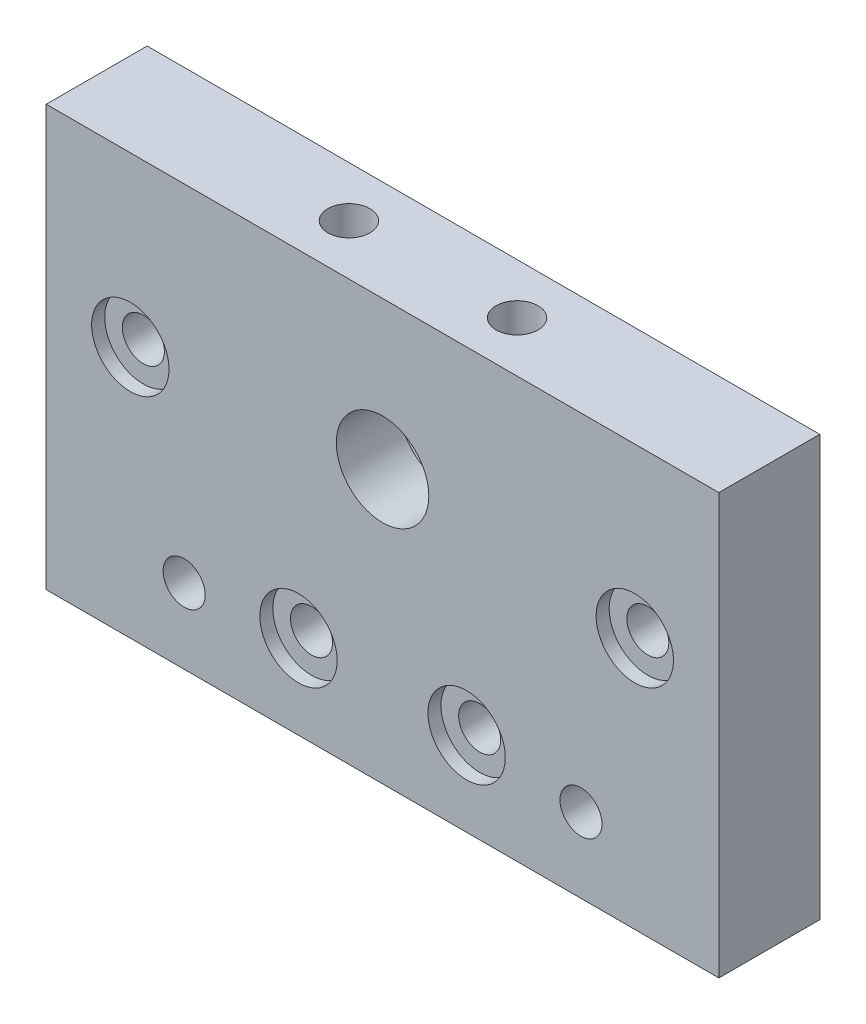
ISO-10303-21;
HEADER;
FILE_DESCRIPTION(('STEP AP214'),'2;1');
FILE_NAME('part.step','',(''),(''),'','','');
FILE_SCHEMA(('AUTOMOTIVE_DESIGN { 1 0 10303 214 1 1 1 1 }'));
ENDSEC;
DATA;
#1=APPLICATION_CONTEXT('core data for automotive mechanical design processes');
#2=APPLICATION_PROTOCOL_DEFINITION('international standard','automotive_design',2000,#1);
#3=PRODUCT_CONTEXT('',#1,'mechanical');
#4=PRODUCT('Part','Part','',(#3));
#5=PRODUCT_RELATED_PRODUCT_CATEGORY('part','',(#4));
#6=PRODUCT_DEFINITION_FORMATION('','',#4);
#7=PRODUCT_DEFINITION_CONTEXT('part definition',#1,'design');
#8=PRODUCT_DEFINITION('design','',#6,#7);
#9=PRODUCT_DEFINITION_SHAPE('','',#8);
#10=(LENGTH_UNIT() NAMED_UNIT(*) SI_UNIT(.MILLI.,.METRE.));
#11=(NAMED_UNIT(*) PLANE_ANGLE_UNIT() SI_UNIT($,.RADIAN.));
#12=(NAMED_UNIT(*) SI_UNIT($,.STERADIAN.) SOLID_ANGLE_UNIT());
#13=UNCERTAINTY_MEASURE_WITH_UNIT(LENGTH_MEASURE(1.E-05),#10,'distance_accuracy_value','');
#14=(GEOMETRIC_REPRESENTATION_CONTEXT(3) GLOBAL_UNCERTAINTY_ASSIGNED_CONTEXT((#13)) GLOBAL_UNIT_ASSIGNED_CONTEXT((#10,
#11,#12)) REPRESENTATION_CONTEXT('',''));
#15=CARTESIAN_POINT('',(0.,0.,0.));
#16=DIRECTION('',(0.,0.,1.));
#17=DIRECTION('',(1.,0.,0.));
#18=AXIS2_PLACEMENT_3D('',#15,#16,#17);
#19=CARTESIAN_POINT('',(40.,32.4,12.));
#20=DIRECTION('',(0.,0.,-1.));
#21=DIRECTION('',(-1.,0.,0.));
#22=AXIS2_PLACEMENT_3D('',#19,#20,#21);
#23=CYLINDRICAL_SURFACE('',#22,5.5);
#24=CARTESIAN_POINT('',(40.,32.4,12.));
#25=DIRECTION('',(0.,0.,1.));
#26=DIRECTION('',(1.,0.,0.));
#27=AXIS2_PLACEMENT_3D('',#24,#25,#26);
#28=CIRCLE('',#27,5.5);
#29=CARTESIAN_POINT('',(45.5,32.4,12.));
#30=VERTEX_POINT('',#29);
#31=EDGE_CURVE('E105',#30,#30,#28,.T.);
#32=ORIENTED_EDGE('',*,*,#31,.T.);
#33=EDGE_LOOP('',(#32));
#34=FACE_BOUND('',#33,.T.);
#35=CARTESIAN_POINT('',(40.,32.4,4.5));
#36=DIRECTION('',(0.,0.,-1.));
#37=DIRECTION('',(-1.,0.,0.));
#38=AXIS2_PLACEMENT_3D('',#35,#36,#37);
#39=CIRCLE('',#38,5.5);
#40=CARTESIAN_POINT('',(34.5,32.4,4.5));
#41=VERTEX_POINT('',#40);
#42=EDGE_CURVE('E38',#41,#41,#39,.T.);
#43=ORIENTED_EDGE('',*,*,#42,.T.);
#44=EDGE_LOOP('',(#43));
#45=FACE_BOUND('',#44,.T.);
#46=ADVANCED_FACE('F34',(#34,#45),#23,.F.);
#47=CARTESIAN_POINT('',(30.,10.,12.));
#48=DIRECTION('',(0.,0.,-1.));
#49=DIRECTION('',(-1.,0.,0.));
#50=AXIS2_PLACEMENT_3D('',#47,#48,#49);
#51=CYLINDRICAL_SURFACE('',#50,2.5);
#52=CARTESIAN_POINT('',(30.,10.,0.));
#53=DIRECTION('',(0.,0.,1.));
#54=DIRECTION('',(1.,0.,0.));
#55=AXIS2_PLACEMENT_3D('',#52,#53,#54);
#56=CIRCLE('',#55,2.5);
#57=CARTESIAN_POINT('',(32.5,10.,0.));
#58=VERTEX_POINT('',#57);
#59=EDGE_CURVE('E168',#58,#58,#56,.T.);
#60=ORIENTED_EDGE('',*,*,#59,.F.);
#61=EDGE_LOOP('',(#60));
#62=FACE_BOUND('',#61,.T.);
#63=CARTESIAN_POINT('',(30.,10.,10.45));
#64=DIRECTION('',(0.,0.,1.));
#65=DIRECTION('',(1.,0.,0.));
#66=AXIS2_PLACEMENT_3D('',#63,#64,#65);
#67=CIRCLE('',#66,2.5);
#68=CARTESIAN_POINT('',(32.5,10.,10.45));
#69=VERTEX_POINT('',#68);
#70=EDGE_CURVE('E121',#69,#69,#67,.T.);
#71=ORIENTED_EDGE('',*,*,#70,.T.);
#72=EDGE_LOOP('',(#71));
#73=FACE_BOUND('',#72,.T.);
#74=ADVANCED_FACE('F210',(#62,#73),#51,.F.);
#75=CARTESIAN_POINT('',(10.,30.,12.));
#76=DIRECTION('',(0.,0.,-1.));
#77=DIRECTION('',(-1.,0.,0.));
#78=AXIS2_PLACEMENT_3D('',#75,#76,#77);
#79=CYLINDRICAL_SURFACE('',#78,2.5);
#80=CARTESIAN_POINT('',(10.,30.,0.));
#81=DIRECTION('',(0.,0.,1.));
#82=DIRECTION('',(1.,0.,0.));
#83=AXIS2_PLACEMENT_3D('',#80,#81,#82);
#84=CIRCLE('',#83,2.5);
#85=CARTESIAN_POINT('',(12.5,30.,0.));
#86=VERTEX_POINT('',#85);
#87=EDGE_CURVE('E174',#86,#86,#84,.T.);
#88=ORIENTED_EDGE('',*,*,#87,.F.);
#89=EDGE_LOOP('',(#88));
#90=FACE_BOUND('',#89,.T.);
#91=CARTESIAN_POINT('',(10.,30.,10.45));
#92=DIRECTION('',(0.,0.,1.));
#93=DIRECTION('',(1.,0.,0.));
#94=AXIS2_PLACEMENT_3D('',#91,#92,#93);
#95=CIRCLE('',#94,2.5);
#96=CARTESIAN_POINT('',(12.5,30.,10.45));
#97=VERTEX_POINT('',#96);
#98=EDGE_CURVE('E111',#97,#97,#95,.T.);
#99=ORIENTED_EDGE('',*,*,#98,.T.);
#100=EDGE_LOOP('',(#99));
#101=FACE_BOUND('',#100,.T.);
#102=ADVANCED_FACE('F184',(#90,#101),#79,.F.);
#103=CARTESIAN_POINT('',(0.,0.,12.));
#104=DIRECTION('',(0.,0.,-1.));
#105=DIRECTION('',(-1.,0.,0.));
#106=AXIS2_PLACEMENT_3D('',#103,#104,#105);
#107=PLANE('',#106);
#108=CARTESIAN_POINT('',(50.,10.,12.));
#109=DIRECTION('',(0.,0.,1.));
#110=DIRECTION('',(-1.,0.,0.));
#111=AXIS2_PLACEMENT_3D('',#108,#109,#110);
#112=CIRCLE('',#111,4.6);
#113=CARTESIAN_POINT('',(45.4,10.,12.));
#114=VERTEX_POINT('',#113);
#115=EDGE_CURVE('E134',#114,#114,#112,.T.);
#116=ORIENTED_EDGE('',*,*,#115,.F.);
#117=EDGE_LOOP('',(#116));
#118=FACE_BOUND('',#117,.T.);
#119=CARTESIAN_POINT('',(30.,10.,12.));
#120=DIRECTION('',(0.,0.,1.));
#121=DIRECTION('',(1.,0.,0.));
#122=AXIS2_PLACEMENT_3D('',#119,#120,#121);
#123=CIRCLE('',#122,4.6);
#124=CARTESIAN_POINT('',(34.6,10.,12.));
#125=VERTEX_POINT('',#124);
#126=EDGE_CURVE('E127',#125,#125,#123,.T.);
#127=ORIENTED_EDGE('',*,*,#126,.F.);
#128=EDGE_LOOP('',(#127));
#129=FACE_BOUND('',#128,.T.);
#130=CARTESIAN_POINT('',(70.,30.,12.));
#131=DIRECTION('',(0.,0.,1.));
#132=DIRECTION('',(-1.,0.,0.));
#133=AXIS2_PLACEMENT_3D('',#130,#131,#132);
#134=CIRCLE('',#133,4.60000000000001);
#135=CARTESIAN_POINT('',(65.4,30.,12.));
#136=VERTEX_POINT('',#135);
#137=EDGE_CURVE('E123',#136,#136,#134,.T.);
#138=ORIENTED_EDGE('',*,*,#137,.F.);
#139=EDGE_LOOP('',(#138));
#140=FACE_BOUND('',#139,.T.);
#141=CARTESIAN_POINT('',(10.,30.,12.));
#142=DIRECTION('',(0.,0.,1.));
#143=DIRECTION('',(1.,0.,0.));
#144=AXIS2_PLACEMENT_3D('',#141,#142,#143);
#145=CIRCLE('',#144,4.6);
#146=CARTESIAN_POINT('',(14.6,30.,12.));
#147=VERTEX_POINT('',#146);
#148=EDGE_CURVE('E119',#147,#147,#145,.T.);
#149=ORIENTED_EDGE('',*,*,#148,.F.);
#150=EDGE_LOOP('',(#149));
#151=FACE_BOUND('',#150,.T.);
#152=DIRECTION('',(0.,-1.,0.));
#153=VECTOR('',#152,1.);
#154=CARTESIAN_POINT('',(0.,0.,12.));
#155=LINE('',#154,#153);
#156=CARTESIAN_POINT('',(0.,50.,12.));
#157=VERTEX_POINT('',#156);
#158=CARTESIAN_POINT('',(0.,0.,12.));
#159=VERTEX_POINT('',#158);
#160=EDGE_CURVE('E89',#157,#159,#155,.T.);
#161=ORIENTED_EDGE('',*,*,#160,.T.);
#162=DIRECTION('',(1.,0.,0.));
#163=VECTOR('',#162,1.);
#164=CARTESIAN_POINT('',(0.,0.,12.));
#165=LINE('',#164,#163);
#166=CARTESIAN_POINT('',(80.,0.,12.));
#167=VERTEX_POINT('',#166);
#168=EDGE_CURVE('E83',#159,#167,#165,.T.);
#169=ORIENTED_EDGE('',*,*,#168,.T.);
#170=DIRECTION('',(0.,1.,0.));
#171=VECTOR('',#170,1.);
#172=CARTESIAN_POINT('',(80.,0.,12.));
#173=LINE('',#172,#171);
#174=CARTESIAN_POINT('',(80.,50.,12.));
#175=VERTEX_POINT('',#174);
#176=EDGE_CURVE('E87',#167,#175,#173,.T.);
#177=ORIENTED_EDGE('',*,*,#176,.T.);
#178=DIRECTION('',(-1.,0.,0.));
#179=VECTOR('',#178,1.);
#180=CARTESIAN_POINT('',(0.,50.,12.));
#181=LINE('',#180,#179);
#182=EDGE_CURVE('E53',#175,#157,#181,.T.);
#183=ORIENTED_EDGE('',*,*,#182,.T.);
#184=EDGE_LOOP('',(#161,#169,#177,#183));
#185=FACE_BOUND('',#184,.T.);
#186=ORIENTED_EDGE('',*,*,#31,.F.);
#187=EDGE_LOOP('',(#186));
#188=FACE_BOUND('',#187,.T.);
#189=CARTESIAN_POINT('',(16.4,8.9,12.));
#190=DIRECTION('',(0.,0.,1.));
#191=DIRECTION('',(1.,0.,0.));
#192=AXIS2_PLACEMENT_3D('',#189,#190,#191);
#193=CIRCLE('',#192,2.5);
#194=CARTESIAN_POINT('',(18.9,8.9,12.));
#195=VERTEX_POINT('',#194);
#196=EDGE_CURVE('E160',#195,#195,#193,.T.);
#197=ORIENTED_EDGE('',*,*,#196,.F.);
#198=EDGE_LOOP('',(#197));
#199=FACE_BOUND('',#198,.T.);
#200=CARTESIAN_POINT('',(63.6,8.9,12.));
#201=DIRECTION('',(0.,0.,1.));
#202=DIRECTION('',(-1.,0.,0.));
#203=AXIS2_PLACEMENT_3D('',#200,#201,#202);
#204=CIRCLE('',#203,2.50000000000001);
#205=CARTESIAN_POINT('',(61.1,8.9,12.));
#206=VERTEX_POINT('',#205);
#207=EDGE_CURVE('E154',#206,#206,#204,.T.);
#208=ORIENTED_EDGE('',*,*,#207,.F.);
#209=EDGE_LOOP('',(#208));
#210=FACE_BOUND('',#209,.T.);
#211=ADVANCED_FACE('F84',(#118,#129,#140,#151,#185,#188,#199,#210),#107,.F.);
#212=CARTESIAN_POINT('',(0.,0.,0.));
#213=DIRECTION('',(0.,0.,-1.));
#214=DIRECTION('',(-1.,0.,0.));
#215=AXIS2_PLACEMENT_3D('',#212,#213,#214);
#216=PLANE('',#215);
#217=CARTESIAN_POINT('',(40.,32.4,0.));
#218=DIRECTION('',(0.,0.,-1.));
#219=DIRECTION('',(-1.,0.,0.));
#220=AXIS2_PLACEMENT_3D('',#217,#218,#219);
#221=CIRCLE('',#220,8.05);
#222=CARTESIAN_POINT('',(31.95,32.4,0.));
#223=VERTEX_POINT('',#222);
#224=EDGE_CURVE('E141',#223,#223,#221,.T.);
#225=ORIENTED_EDGE('',*,*,#224,.F.);
#226=EDGE_LOOP('',(#225));
#227=FACE_BOUND('',#226,.T.);
#228=CARTESIAN_POINT('',(16.4,8.9,0.));
#229=DIRECTION('',(0.,0.,1.));
#230=DIRECTION('',(1.,0.,0.));
#231=AXIS2_PLACEMENT_3D('',#228,#229,#230);
#232=CIRCLE('',#231,2.5);
#233=CARTESIAN_POINT('',(18.9,8.9,0.));
#234=VERTEX_POINT('',#233);
#235=EDGE_CURVE('E157',#234,#234,#232,.T.);
#236=ORIENTED_EDGE('',*,*,#235,.T.);
#237=EDGE_LOOP('',(#236));
#238=FACE_BOUND('',#237,.T.);
#239=ORIENTED_EDGE('',*,*,#59,.T.);
#240=EDGE_LOOP('',(#239));
#241=FACE_BOUND('',#240,.T.);
#242=ORIENTED_EDGE('',*,*,#87,.T.);
#243=EDGE_LOOP('',(#242));
#244=FACE_BOUND('',#243,.T.);
#245=DIRECTION('',(0.,-1.,0.));
#246=VECTOR('',#245,1.);
#247=CARTESIAN_POINT('',(0.,0.,0.));
#248=LINE('',#247,#246);
#249=CARTESIAN_POINT('',(0.,50.,0.));
#250=VERTEX_POINT('',#249);
#251=CARTESIAN_POINT('',(0.,0.,0.));
#252=VERTEX_POINT('',#251);
#253=EDGE_CURVE('E102',#250,#252,#248,.T.);
#254=ORIENTED_EDGE('',*,*,#253,.F.);
#255=DIRECTION('',(-1.,0.,0.));
#256=VECTOR('',#255,1.);
#257=CARTESIAN_POINT('',(0.,50.,0.));
#258=LINE('',#257,#256);
#259=CARTESIAN_POINT('',(80.,50.,0.));
#260=VERTEX_POINT('',#259);
#261=EDGE_CURVE('E76',#260,#250,#258,.T.);
#262=ORIENTED_EDGE('',*,*,#261,.F.);
#263=DIRECTION('',(0.,1.,0.));
#264=VECTOR('',#263,1.);
#265=CARTESIAN_POINT('',(80.,0.,0.));
#266=LINE('',#265,#264);
#267=CARTESIAN_POINT('',(80.,0.,0.));
#268=VERTEX_POINT('',#267);
#269=EDGE_CURVE('E70',#268,#260,#266,.T.);
#270=ORIENTED_EDGE('',*,*,#269,.F.);
#271=DIRECTION('',(1.,0.,0.));
#272=VECTOR('',#271,1.);
#273=CARTESIAN_POINT('',(0.,0.,0.));
#274=LINE('',#273,#272);
#275=EDGE_CURVE('E93',#252,#268,#274,.T.);
#276=ORIENTED_EDGE('',*,*,#275,.F.);
#277=EDGE_LOOP('',(#254,#262,#270,#276));
#278=FACE_BOUND('',#277,.T.);
#279=CARTESIAN_POINT('',(70.,30.,0.));
#280=DIRECTION('',(0.,0.,1.));
#281=DIRECTION('',(-1.,0.,0.));
#282=AXIS2_PLACEMENT_3D('',#279,#280,#281);
#283=CIRCLE('',#282,2.50000000000001);
#284=CARTESIAN_POINT('',(67.5,30.,0.));
#285=VERTEX_POINT('',#284);
#286=EDGE_CURVE('E171',#285,#285,#283,.T.);
#287=ORIENTED_EDGE('',*,*,#286,.T.);
#288=EDGE_LOOP('',(#287));
#289=FACE_BOUND('',#288,.T.);
#290=CARTESIAN_POINT('',(50.,10.,0.));
#291=DIRECTION('',(0.,0.,1.));
#292=DIRECTION('',(-1.,0.,0.));
#293=AXIS2_PLACEMENT_3D('',#290,#291,#292);
#294=CIRCLE('',#293,2.5);
#295=CARTESIAN_POINT('',(47.5,10.,0.));
#296=VERTEX_POINT('',#295);
#297=EDGE_CURVE('E163',#296,#296,#294,.T.);
#298=ORIENTED_EDGE('',*,*,#297,.T.);
#299=EDGE_LOOP('',(#298));
#300=FACE_BOUND('',#299,.T.);
#301=CARTESIAN_POINT('',(63.6,8.9,0.));
#302=DIRECTION('',(0.,0.,1.));
#303=DIRECTION('',(-1.,0.,0.));
#304=AXIS2_PLACEMENT_3D('',#301,#302,#303);
#305=CIRCLE('',#304,2.50000000000001);
#306=CARTESIAN_POINT('',(61.1,8.9,0.));
#307=VERTEX_POINT('',#306);
#308=EDGE_CURVE('E114',#307,#307,#305,.T.);
#309=ORIENTED_EDGE('',*,*,#308,.T.);
#310=EDGE_LOOP('',(#309));
#311=FACE_BOUND('',#310,.T.);
#312=ADVANCED_FACE('F183',(#227,#238,#241,#244,#278,#289,#300,#311),#216,.T.);
#313=CARTESIAN_POINT('',(0.,0.,12.));
#314=DIRECTION('',(1.,0.,0.));
#315=DIRECTION('',(0.,0.,-1.));
#316=AXIS2_PLACEMENT_3D('',#313,#314,#315);
#317=PLANE('',#316);
#318=ORIENTED_EDGE('',*,*,#253,.T.);
#319=DIRECTION('',(0.,0.,-1.));
#320=VECTOR('',#319,1.);
#321=CARTESIAN_POINT('',(0.,0.,12.));
#322=LINE('',#321,#320);
#323=EDGE_CURVE('E11',#159,#252,#322,.T.);
#324=ORIENTED_EDGE('',*,*,#323,.F.);
#325=ORIENTED_EDGE('',*,*,#160,.F.);
#326=DIRECTION('',(0.,0.,-1.));
#327=VECTOR('',#326,1.);
#328=CARTESIAN_POINT('',(0.,50.,12.));
#329=LINE('',#328,#327);
#330=EDGE_CURVE('E98',#157,#250,#329,.T.);
#331=ORIENTED_EDGE('',*,*,#330,.T.);
#332=EDGE_LOOP('',(#318,#324,#325,#331));
#333=FACE_BOUND('',#332,.T.);
#334=ADVANCED_FACE('F36',(#333),#317,.F.);
#335=CARTESIAN_POINT('',(0.,0.,12.));
#336=DIRECTION('',(0.,1.,0.));
#337=DIRECTION('',(0.,0.,1.));
#338=AXIS2_PLACEMENT_3D('',#335,#336,#337);
#339=PLANE('',#338);
#340=ORIENTED_EDGE('',*,*,#275,.T.);
#341=DIRECTION('',(0.,0.,-1.));
#342=VECTOR('',#341,1.);
#343=CARTESIAN_POINT('',(80.,0.,12.));
#344=LINE('',#343,#342);
#345=EDGE_CURVE('E44',#167,#268,#344,.T.);
#346=ORIENTED_EDGE('',*,*,#345,.F.);
#347=ORIENTED_EDGE('',*,*,#168,.F.);
#348=ORIENTED_EDGE('',*,*,#323,.T.);
#349=EDGE_LOOP('',(#340,#346,#347,#348));
#350=FACE_BOUND('',#349,.T.);
#351=ADVANCED_FACE('F92',(#350),#339,.F.);
#352=CARTESIAN_POINT('',(80.,0.,12.));
#353=DIRECTION('',(-1.,0.,0.));
#354=DIRECTION('',(0.,0.,1.));
#355=AXIS2_PLACEMENT_3D('',#352,#353,#354);
#356=PLANE('',#355);
#357=ORIENTED_EDGE('',*,*,#269,.T.);
#358=DIRECTION('',(0.,0.,-1.));
#359=VECTOR('',#358,1.);
#360=CARTESIAN_POINT('',(80.,50.,12.));
#361=LINE('',#360,#359);
#362=EDGE_CURVE('E94',#175,#260,#361,.T.);
#363=ORIENTED_EDGE('',*,*,#362,.F.);
#364=ORIENTED_EDGE('',*,*,#176,.F.);
#365=ORIENTED_EDGE('',*,*,#345,.T.);
#366=EDGE_LOOP('',(#357,#363,#364,#365));
#367=FACE_BOUND('',#366,.T.);
#368=ADVANCED_FACE('F96',(#367),#356,.F.);
#369=CARTESIAN_POINT('',(0.,50.,12.));
#370=DIRECTION('',(0.,-1.,0.));
#371=DIRECTION('',(0.,0.,-1.));
#372=AXIS2_PLACEMENT_3D('',#369,#370,#371);
#373=PLANE('',#372);
#374=CARTESIAN_POINT('',(30.,50.,5.99999999999999));
#375=DIRECTION('',(0.,1.,0.));
#376=DIRECTION('',(0.,0.,-1.));
#377=AXIS2_PLACEMENT_3D('',#374,#375,#376);
#378=CIRCLE('',#377,2.5);
#379=CARTESIAN_POINT('',(30.,50.,3.49999999999999));
#380=VERTEX_POINT('',#379);
#381=EDGE_CURVE('E292',#380,#380,#378,.T.);
#382=ORIENTED_EDGE('',*,*,#381,.F.);
#383=EDGE_LOOP('',(#382));
#384=FACE_BOUND('',#383,.T.);
#385=CARTESIAN_POINT('',(50.,50.,5.99999999999999));
#386=DIRECTION('',(0.,1.,0.));
#387=DIRECTION('',(0.,0.,1.));
#388=AXIS2_PLACEMENT_3D('',#385,#386,#387);
#389=CIRCLE('',#388,2.5);
#390=CARTESIAN_POINT('',(50.,50.,8.5));
#391=VERTEX_POINT('',#390);
#392=EDGE_CURVE('E291',#391,#391,#389,.T.);
#393=ORIENTED_EDGE('',*,*,#392,.F.);
#394=EDGE_LOOP('',(#393));
#395=FACE_BOUND('',#394,.T.);
#396=ORIENTED_EDGE('',*,*,#261,.T.);
#397=ORIENTED_EDGE('',*,*,#330,.F.);
#398=ORIENTED_EDGE('',*,*,#182,.F.);
#399=ORIENTED_EDGE('',*,*,#362,.T.);
#400=EDGE_LOOP('',(#396,#397,#398,#399));
#401=FACE_BOUND('',#400,.T.);
#402=ADVANCED_FACE('F224',(#384,#395,#401),#373,.F.);
#403=CARTESIAN_POINT('',(70.,30.,12.));
#404=DIRECTION('',(0.,0.,-1.));
#405=DIRECTION('',(-1.,0.,0.));
#406=AXIS2_PLACEMENT_3D('',#403,#404,#405);
#407=CYLINDRICAL_SURFACE('',#406,2.50000000000001);
#408=CARTESIAN_POINT('',(70.,30.,10.45));
#409=DIRECTION('',(0.,0.,-1.));
#410=DIRECTION('',(-1.,0.,0.));
#411=AXIS2_PLACEMENT_3D('',#408,#409,#410);
#412=CIRCLE('',#411,2.50000000000001);
#413=CARTESIAN_POINT('',(67.5,30.,10.45));
#414=VERTEX_POINT('',#413);
#415=EDGE_CURVE('E116',#414,#414,#412,.T.);
#416=ORIENTED_EDGE('',*,*,#415,.F.);
#417=EDGE_LOOP('',(#416));
#418=FACE_BOUND('',#417,.T.);
#419=ORIENTED_EDGE('',*,*,#286,.F.);
#420=EDGE_LOOP('',(#419));
#421=FACE_BOUND('',#420,.T.);
#422=ADVANCED_FACE('F221',(#418,#421),#407,.F.);
#423=CARTESIAN_POINT('',(50.,10.,12.));
#424=DIRECTION('',(0.,0.,-1.));
#425=DIRECTION('',(-1.,0.,0.));
#426=AXIS2_PLACEMENT_3D('',#423,#424,#425);
#427=CYLINDRICAL_SURFACE('',#426,2.5);
#428=CARTESIAN_POINT('',(50.,10.,10.45));
#429=DIRECTION('',(0.,0.,-1.));
#430=DIRECTION('',(-1.,0.,0.));
#431=AXIS2_PLACEMENT_3D('',#428,#429,#430);
#432=CIRCLE('',#431,2.5);
#433=CARTESIAN_POINT('',(47.5,10.,10.45));
#434=VERTEX_POINT('',#433);
#435=EDGE_CURVE('E125',#434,#434,#432,.T.);
#436=ORIENTED_EDGE('',*,*,#435,.F.);
#437=EDGE_LOOP('',(#436));
#438=FACE_BOUND('',#437,.T.);
#439=ORIENTED_EDGE('',*,*,#297,.F.);
#440=EDGE_LOOP('',(#439));
#441=FACE_BOUND('',#440,.T.);
#442=ADVANCED_FACE('F223',(#438,#441),#427,.F.);
#443=CARTESIAN_POINT('',(16.4,8.9,12.));
#444=DIRECTION('',(0.,0.,-1.));
#445=DIRECTION('',(-1.,0.,0.));
#446=AXIS2_PLACEMENT_3D('',#443,#444,#445);
#447=CYLINDRICAL_SURFACE('',#446,2.5);
#448=ORIENTED_EDGE('',*,*,#196,.T.);
#449=EDGE_LOOP('',(#448));
#450=FACE_BOUND('',#449,.T.);
#451=ORIENTED_EDGE('',*,*,#235,.F.);
#452=EDGE_LOOP('',(#451));
#453=FACE_BOUND('',#452,.T.);
#454=ADVANCED_FACE('F195',(#450,#453),#447,.F.);
#455=CARTESIAN_POINT('',(63.6,8.9,12.));
#456=DIRECTION('',(0.,0.,-1.));
#457=DIRECTION('',(-1.,0.,0.));
#458=AXIS2_PLACEMENT_3D('',#455,#456,#457);
#459=CYLINDRICAL_SURFACE('',#458,2.50000000000001);
#460=ORIENTED_EDGE('',*,*,#207,.T.);
#461=EDGE_LOOP('',(#460));
#462=FACE_BOUND('',#461,.T.);
#463=ORIENTED_EDGE('',*,*,#308,.F.);
#464=EDGE_LOOP('',(#463));
#465=FACE_BOUND('',#464,.T.);
#466=ADVANCED_FACE('F191',(#462,#465),#459,.F.);
#467=CARTESIAN_POINT('',(10.,30.,10.45));
#468=DIRECTION('',(0.,0.,1.));
#469=DIRECTION('',(1.,0.,0.));
#470=AXIS2_PLACEMENT_3D('',#467,#468,#469);
#471=CYLINDRICAL_SURFACE('',#470,4.6);
#472=CARTESIAN_POINT('',(10.,30.,10.45));
#473=DIRECTION('',(0.,0.,1.));
#474=DIRECTION('',(1.,0.,0.));
#475=AXIS2_PLACEMENT_3D('',#472,#473,#474);
#476=CIRCLE('',#475,4.6);
#477=CARTESIAN_POINT('',(14.6,30.,10.45));
#478=VERTEX_POINT('',#477);
#479=EDGE_CURVE('E115',#478,#478,#476,.T.);
#480=ORIENTED_EDGE('',*,*,#479,.F.);
#481=EDGE_LOOP('',(#480));
#482=FACE_BOUND('',#481,.T.);
#483=ORIENTED_EDGE('',*,*,#148,.T.);
#484=EDGE_LOOP('',(#483));
#485=FACE_BOUND('',#484,.T.);
#486=ADVANCED_FACE('F194',(#482,#485),#471,.F.);
#487=CARTESIAN_POINT('',(10.,30.,10.45));
#488=DIRECTION('',(0.,0.,1.));
#489=DIRECTION('',(1.,0.,0.));
#490=AXIS2_PLACEMENT_3D('',#487,#488,#489);
#491=PLANE('',#490);
#492=ORIENTED_EDGE('',*,*,#98,.F.);
#493=EDGE_LOOP('',(#492));
#494=FACE_BOUND('',#493,.T.);
#495=ORIENTED_EDGE('',*,*,#479,.T.);
#496=EDGE_LOOP('',(#495));
#497=FACE_BOUND('',#496,.T.);
#498=ADVANCED_FACE('F235',(#494,#497),#491,.T.);
#499=CARTESIAN_POINT('',(70.,30.,10.45));
#500=DIRECTION('',(0.,0.,1.));
#501=DIRECTION('',(1.,0.,0.));
#502=AXIS2_PLACEMENT_3D('',#499,#500,#501);
#503=CYLINDRICAL_SURFACE('',#502,4.60000000000001);
#504=CARTESIAN_POINT('',(70.,30.,10.45));
#505=DIRECTION('',(0.,0.,1.));
#506=DIRECTION('',(-1.,0.,0.));
#507=AXIS2_PLACEMENT_3D('',#504,#505,#506);
#508=CIRCLE('',#507,4.60000000000001);
#509=CARTESIAN_POINT('',(65.4,30.,10.45));
#510=VERTEX_POINT('',#509);
#511=EDGE_CURVE('E120',#510,#510,#508,.T.);
#512=ORIENTED_EDGE('',*,*,#511,.F.);
#513=EDGE_LOOP('',(#512));
#514=FACE_BOUND('',#513,.T.);
#515=ORIENTED_EDGE('',*,*,#137,.T.);
#516=EDGE_LOOP('',(#515));
#517=FACE_BOUND('',#516,.T.);
#518=ADVANCED_FACE('F239',(#514,#517),#503,.F.);
#519=CARTESIAN_POINT('',(70.,30.,10.45));
#520=DIRECTION('',(0.,0.,-1.));
#521=DIRECTION('',(-1.,0.,0.));
#522=AXIS2_PLACEMENT_3D('',#519,#520,#521);
#523=PLANE('',#522);
#524=ORIENTED_EDGE('',*,*,#415,.T.);
#525=EDGE_LOOP('',(#524));
#526=FACE_BOUND('',#525,.T.);
#527=ORIENTED_EDGE('',*,*,#511,.T.);
#528=EDGE_LOOP('',(#527));
#529=FACE_BOUND('',#528,.T.);
#530=ADVANCED_FACE('F243',(#526,#529),#523,.F.);
#531=CARTESIAN_POINT('',(30.,10.,10.45));
#532=DIRECTION('',(0.,0.,1.));
#533=DIRECTION('',(1.,0.,0.));
#534=AXIS2_PLACEMENT_3D('',#531,#532,#533);
#535=CYLINDRICAL_SURFACE('',#534,4.6);
#536=CARTESIAN_POINT('',(30.,10.,10.45));
#537=DIRECTION('',(0.,0.,1.));
#538=DIRECTION('',(1.,0.,0.));
#539=AXIS2_PLACEMENT_3D('',#536,#537,#538);
#540=CIRCLE('',#539,4.6);
#541=CARTESIAN_POINT('',(34.6,10.,10.45));
#542=VERTEX_POINT('',#541);
#543=EDGE_CURVE('E124',#542,#542,#540,.T.);
#544=ORIENTED_EDGE('',*,*,#543,.F.);
#545=EDGE_LOOP('',(#544));
#546=FACE_BOUND('',#545,.T.);
#547=ORIENTED_EDGE('',*,*,#126,.T.);
#548=EDGE_LOOP('',(#547));
#549=FACE_BOUND('',#548,.T.);
#550=ADVANCED_FACE('F247',(#546,#549),#535,.F.);
#551=CARTESIAN_POINT('',(30.,10.,10.45));
#552=DIRECTION('',(0.,0.,1.));
#553=DIRECTION('',(1.,0.,0.));
#554=AXIS2_PLACEMENT_3D('',#551,#552,#553);
#555=PLANE('',#554);
#556=ORIENTED_EDGE('',*,*,#70,.F.);
#557=EDGE_LOOP('',(#556));
#558=FACE_BOUND('',#557,.T.);
#559=ORIENTED_EDGE('',*,*,#543,.T.);
#560=EDGE_LOOP('',(#559));
#561=FACE_BOUND('',#560,.T.);
#562=ADVANCED_FACE('F251',(#558,#561),#555,.T.);
#563=CARTESIAN_POINT('',(50.,10.,10.45));
#564=DIRECTION('',(0.,0.,1.));
#565=DIRECTION('',(1.,0.,0.));
#566=AXIS2_PLACEMENT_3D('',#563,#564,#565);
#567=CYLINDRICAL_SURFACE('',#566,4.6);
#568=CARTESIAN_POINT('',(50.,10.,10.45));
#569=DIRECTION('',(0.,0.,1.));
#570=DIRECTION('',(-1.,0.,0.));
#571=AXIS2_PLACEMENT_3D('',#568,#569,#570);
#572=CIRCLE('',#571,4.6);
#573=CARTESIAN_POINT('',(45.4,10.,10.45));
#574=VERTEX_POINT('',#573);
#575=EDGE_CURVE('E128',#574,#574,#572,.T.);
#576=ORIENTED_EDGE('',*,*,#575,.F.);
#577=EDGE_LOOP('',(#576));
#578=FACE_BOUND('',#577,.T.);
#579=ORIENTED_EDGE('',*,*,#115,.T.);
#580=EDGE_LOOP('',(#579));
#581=FACE_BOUND('',#580,.T.);
#582=ADVANCED_FACE('F255',(#578,#581),#567,.F.);
#583=CARTESIAN_POINT('',(50.,10.,10.45));
#584=DIRECTION('',(0.,0.,-1.));
#585=DIRECTION('',(-1.,0.,0.));
#586=AXIS2_PLACEMENT_3D('',#583,#584,#585);
#587=PLANE('',#586);
#588=ORIENTED_EDGE('',*,*,#435,.T.);
#589=EDGE_LOOP('',(#588));
#590=FACE_BOUND('',#589,.T.);
#591=ORIENTED_EDGE('',*,*,#575,.T.);
#592=EDGE_LOOP('',(#591));
#593=FACE_BOUND('',#592,.T.);
#594=ADVANCED_FACE('F259',(#590,#593),#587,.F.);
#595=CARTESIAN_POINT('',(40.,32.4,4.5));
#596=DIRECTION('',(0.,0.,-1.));
#597=DIRECTION('',(-1.,0.,0.));
#598=AXIS2_PLACEMENT_3D('',#595,#596,#597);
#599=CYLINDRICAL_SURFACE('',#598,8.05);
#600=CARTESIAN_POINT('',(40.,32.4,4.5));
#601=DIRECTION('',(0.,0.,-1.));
#602=DIRECTION('',(-1.,0.,0.));
#603=AXIS2_PLACEMENT_3D('',#600,#601,#602);
#604=CIRCLE('',#603,8.05);
#605=CARTESIAN_POINT('',(31.95,32.4,4.5));
#606=VERTEX_POINT('',#605);
#607=EDGE_CURVE('E301',#606,#606,#604,.T.);
#608=ORIENTED_EDGE('',*,*,#607,.F.);
#609=EDGE_LOOP('',(#608));
#610=FACE_BOUND('',#609,.T.);
#611=ORIENTED_EDGE('',*,*,#224,.T.);
#612=EDGE_LOOP('',(#611));
#613=FACE_BOUND('',#612,.T.);
#614=ADVANCED_FACE('F263',(#610,#613),#599,.F.);
#615=CARTESIAN_POINT('',(40.,32.4,4.5));
#616=DIRECTION('',(0.,0.,-1.));
#617=DIRECTION('',(-1.,0.,0.));
#618=AXIS2_PLACEMENT_3D('',#615,#616,#617);
#619=PLANE('',#618);
#620=ORIENTED_EDGE('',*,*,#42,.F.);
#621=EDGE_LOOP('',(#620));
#622=FACE_BOUND('',#621,.T.);
#623=ORIENTED_EDGE('',*,*,#607,.T.);
#624=EDGE_LOOP('',(#623));
#625=FACE_BOUND('',#624,.T.);
#626=ADVANCED_FACE('F266',(#622,#625),#619,.T.);
#627=CARTESIAN_POINT('',(50.,39.,5.99999999999999));
#628=DIRECTION('',(0.,1.,0.));
#629=DIRECTION('',(0.,0.,1.));
#630=AXIS2_PLACEMENT_3D('',#627,#628,#629);
#631=CYLINDRICAL_SURFACE('',#630,2.5);
#632=CARTESIAN_POINT('',(50.,39.,5.99999999999999));
#633=DIRECTION('',(0.,1.,0.));
#634=DIRECTION('',(0.,0.,1.));
#635=AXIS2_PLACEMENT_3D('',#632,#633,#634);
#636=CIRCLE('',#635,2.5);
#637=CARTESIAN_POINT('',(50.,39.,8.5));
#638=VERTEX_POINT('',#637);
#639=EDGE_CURVE('E295',#638,#638,#636,.T.);
#640=ORIENTED_EDGE('',*,*,#639,.F.);
#641=EDGE_LOOP('',(#640));
#642=FACE_BOUND('',#641,.T.);
#643=ORIENTED_EDGE('',*,*,#392,.T.);
#644=EDGE_LOOP('',(#643));
#645=FACE_BOUND('',#644,.T.);
#646=ADVANCED_FACE('F270',(#642,#645),#631,.F.);
#647=CARTESIAN_POINT('',(50.,39.,5.99999999999999));
#648=DIRECTION('',(0.,1.,0.));
#649=DIRECTION('',(0.,0.,1.));
#650=AXIS2_PLACEMENT_3D('',#647,#648,#649);
#651=PLANE('',#650);
#652=ORIENTED_EDGE('',*,*,#639,.T.);
#653=EDGE_LOOP('',(#652));
#654=FACE_BOUND('',#653,.T.);
#655=ADVANCED_FACE('F274',(#654),#651,.T.);
#656=CARTESIAN_POINT('',(30.,39.,5.99999999999999));
#657=DIRECTION('',(0.,1.,0.));
#658=DIRECTION('',(0.,0.,1.));
#659=AXIS2_PLACEMENT_3D('',#656,#657,#658);
#660=CYLINDRICAL_SURFACE('',#659,2.5);
#661=CARTESIAN_POINT('',(30.,39.,5.99999999999999));
#662=DIRECTION('',(0.,1.,0.));
#663=DIRECTION('',(0.,0.,-1.));
#664=AXIS2_PLACEMENT_3D('',#661,#662,#663);
#665=CIRCLE('',#664,2.5);
#666=CARTESIAN_POINT('',(30.,39.,3.49999999999999));
#667=VERTEX_POINT('',#666);
#668=EDGE_CURVE('E290',#667,#667,#665,.T.);
#669=ORIENTED_EDGE('',*,*,#668,.F.);
#670=EDGE_LOOP('',(#669));
#671=FACE_BOUND('',#670,.T.);
#672=ORIENTED_EDGE('',*,*,#381,.T.);
#673=EDGE_LOOP('',(#672));
#674=FACE_BOUND('',#673,.T.);
#675=ADVANCED_FACE('F278',(#671,#674),#660,.F.);
#676=CARTESIAN_POINT('',(30.,39.,5.99999999999999));
#677=DIRECTION('',(0.,-1.,0.));
#678=DIRECTION('',(0.,0.,-1.));
#679=AXIS2_PLACEMENT_3D('',#676,#677,#678);
#680=PLANE('',#679);
#681=ORIENTED_EDGE('',*,*,#668,.T.);
#682=EDGE_LOOP('',(#681));
#683=FACE_BOUND('',#682,.T.);
#684=ADVANCED_FACE('F282',(#683),#680,.F.);
#685=CLOSED_SHELL('',(#46,#74,#102,#211,#312,#334,#351,#368,#402,#422,#442,#454,#466,#486,#498,
#518,#530,#550,#562,#582,#594,#614,#626,#646,#655,#675,#684));
#686=MANIFOLD_SOLID_BREP('B2',#685);
#687=ADVANCED_BREP_SHAPE_REPRESENTATION('',(#18,#686),#14);
#688=SHAPE_DEFINITION_REPRESENTATION(#9,#687);
ENDSEC;
END-ISO-10303-21;
